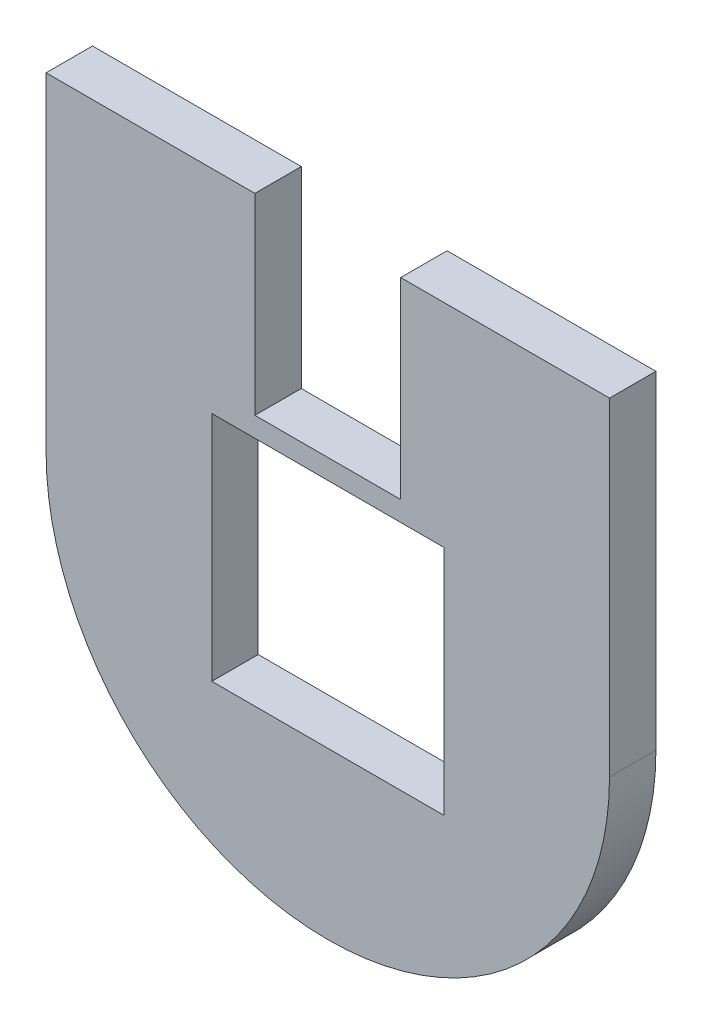
ISO-10303-21;
HEADER;
FILE_DESCRIPTION(('STEP AP214'),'2;1');
FILE_NAME('part.step','',(''),(''),'','','');
FILE_SCHEMA(('AUTOMOTIVE_DESIGN { 1 0 10303 214 1 1 1 1 }'));
ENDSEC;
DATA;
#1=APPLICATION_CONTEXT('core data for automotive mechanical design processes');
#2=APPLICATION_PROTOCOL_DEFINITION('international standard','automotive_design',2000,#1);
#3=PRODUCT_CONTEXT('',#1,'mechanical');
#4=PRODUCT('Part','Part','',(#3));
#5=PRODUCT_RELATED_PRODUCT_CATEGORY('part','',(#4));
#6=PRODUCT_DEFINITION_FORMATION('','',#4);
#7=PRODUCT_DEFINITION_CONTEXT('part definition',#1,'design');
#8=PRODUCT_DEFINITION('design','',#6,#7);
#9=PRODUCT_DEFINITION_SHAPE('','',#8);
#10=(LENGTH_UNIT() NAMED_UNIT(*) SI_UNIT(.MILLI.,.METRE.));
#11=(NAMED_UNIT(*) PLANE_ANGLE_UNIT() SI_UNIT($,.RADIAN.));
#12=(NAMED_UNIT(*) SI_UNIT($,.STERADIAN.) SOLID_ANGLE_UNIT());
#13=UNCERTAINTY_MEASURE_WITH_UNIT(LENGTH_MEASURE(1.E-05),#10,'distance_accuracy_value','');
#14=(GEOMETRIC_REPRESENTATION_CONTEXT(3) GLOBAL_UNCERTAINTY_ASSIGNED_CONTEXT((#13)) GLOBAL_UNIT_ASSIGNED_CONTEXT((#10,
#11,#12)) REPRESENTATION_CONTEXT('',''));
#15=CARTESIAN_POINT('',(0.,0.,0.));
#16=DIRECTION('',(0.,0.,1.));
#17=DIRECTION('',(1.,0.,0.));
#18=AXIS2_PLACEMENT_3D('',#15,#16,#17);
#19=CARTESIAN_POINT('',(0.,0.,7.));
#20=DIRECTION('',(0.,0.,-1.));
#21=DIRECTION('',(-1.,0.,0.));
#22=AXIS2_PLACEMENT_3D('',#19,#20,#21);
#23=PLANE('',#22);
#24=DIRECTION('',(-1.,0.,0.));
#25=VECTOR('',#24,1.);
#26=CARTESIAN_POINT('',(25.,62.5,7.));
#27=LINE('',#26,#25);
#28=CARTESIAN_POINT('',(60.,62.5,7.));
#29=VERTEX_POINT('',#28);
#30=CARTESIAN_POINT('',(25.,62.5,7.));
#31=VERTEX_POINT('',#30);
#32=EDGE_CURVE('E206',#29,#31,#27,.T.);
#33=ORIENTED_EDGE('',*,*,#32,.F.);
#34=DIRECTION('',(0.,1.,0.));
#35=VECTOR('',#34,1.);
#36=CARTESIAN_POINT('',(60.,27.5,7.));
#37=LINE('',#36,#35);
#38=CARTESIAN_POINT('',(60.,27.5,7.));
#39=VERTEX_POINT('',#38);
#40=EDGE_CURVE('E203',#39,#29,#37,.T.);
#41=ORIENTED_EDGE('',*,*,#40,.F.);
#42=DIRECTION('',(1.,0.,0.));
#43=VECTOR('',#42,1.);
#44=CARTESIAN_POINT('',(25.,27.5,7.));
#45=LINE('',#44,#43);
#46=CARTESIAN_POINT('',(25.,27.5,7.));
#47=VERTEX_POINT('',#46);
#48=EDGE_CURVE('E177',#47,#39,#45,.T.);
#49=ORIENTED_EDGE('',*,*,#48,.F.);
#50=DIRECTION('',(0.,-1.,0.));
#51=VECTOR('',#50,1.);
#52=CARTESIAN_POINT('',(25.,27.5,7.));
#53=LINE('',#52,#51);
#54=EDGE_CURVE('E209',#31,#47,#53,.T.);
#55=ORIENTED_EDGE('',*,*,#54,.F.);
#56=EDGE_LOOP('',(#33,#41,#49,#55));
#57=FACE_BOUND('',#56,.T.);
#58=DIRECTION('',(1.,0.,0.));
#59=VECTOR('',#58,1.);
#60=CARTESIAN_POINT('',(0.,94.5,7.));
#61=LINE('',#60,#59);
#62=CARTESIAN_POINT('',(0.,94.5,7.));
#63=VERTEX_POINT('',#62);
#64=CARTESIAN_POINT('',(31.5,94.5,7.));
#65=VERTEX_POINT('',#64);
#66=EDGE_CURVE('E63',#63,#65,#61,.T.);
#67=ORIENTED_EDGE('',*,*,#66,.F.);
#68=DIRECTION('',(0.,-1.,0.));
#69=VECTOR('',#68,1.);
#70=CARTESIAN_POINT('',(0.,0.,7.));
#71=LINE('',#70,#69);
#72=CARTESIAN_POINT('',(0.,45.,7.));
#73=VERTEX_POINT('',#72);
#74=EDGE_CURVE('E55',#63,#73,#71,.T.);
#75=ORIENTED_EDGE('',*,*,#74,.T.);
#76=CARTESIAN_POINT('',(42.5,45.,7.));
#77=DIRECTION('',(0.,0.,-1.));
#78=DIRECTION('',(-1.,0.,0.));
#79=AXIS2_PLACEMENT_3D('',#76,#77,#78);
#80=CIRCLE('',#79,42.5);
#81=CARTESIAN_POINT('',(85.,45.,7.));
#82=VERTEX_POINT('',#81);
#83=EDGE_CURVE('E207',#73,#82,#80,.F.);
#84=ORIENTED_EDGE('',*,*,#83,.T.);
#85=DIRECTION('',(0.,1.,0.));
#86=VECTOR('',#85,1.);
#87=CARTESIAN_POINT('',(85.,0.,7.));
#88=LINE('',#87,#86);
#89=CARTESIAN_POINT('',(85.,94.5,7.));
#90=VERTEX_POINT('',#89);
#91=EDGE_CURVE('E11',#82,#90,#88,.T.);
#92=ORIENTED_EDGE('',*,*,#91,.T.);
#93=DIRECTION('',(1.,0.,0.));
#94=VECTOR('',#93,1.);
#95=CARTESIAN_POINT('',(53.5,94.5,7.));
#96=LINE('',#95,#94);
#97=CARTESIAN_POINT('',(53.5,94.5,7.));
#98=VERTEX_POINT('',#97);
#99=EDGE_CURVE('E261',#98,#90,#96,.T.);
#100=ORIENTED_EDGE('',*,*,#99,.F.);
#101=DIRECTION('',(0.,-1.,0.));
#102=VECTOR('',#101,1.);
#103=CARTESIAN_POINT('',(53.5,0.,7.));
#104=LINE('',#103,#102);
#105=CARTESIAN_POINT('',(53.5,65.5,7.));
#106=VERTEX_POINT('',#105);
#107=EDGE_CURVE('E238',#98,#106,#104,.T.);
#108=ORIENTED_EDGE('',*,*,#107,.T.);
#109=DIRECTION('',(-1.,0.,0.));
#110=VECTOR('',#109,1.);
#111=CARTESIAN_POINT('',(0.,65.5,7.));
#112=LINE('',#111,#110);
#113=CARTESIAN_POINT('',(31.5,65.5,7.));
#114=VERTEX_POINT('',#113);
#115=EDGE_CURVE('E235',#106,#114,#112,.T.);
#116=ORIENTED_EDGE('',*,*,#115,.T.);
#117=DIRECTION('',(0.,-1.,0.));
#118=VECTOR('',#117,1.);
#119=CARTESIAN_POINT('',(31.5,0.,7.));
#120=LINE('',#119,#118);
#121=EDGE_CURVE('E150',#65,#114,#120,.T.);
#122=ORIENTED_EDGE('',*,*,#121,.F.);
#123=EDGE_LOOP('',(#67,#75,#84,#92,#100,#108,#116,#122));
#124=FACE_BOUND('',#123,.T.);
#125=ADVANCED_FACE('F45',(#57,#124),#23,.F.);
#126=CARTESIAN_POINT('',(0.,0.,0.));
#127=DIRECTION('',(0.,0.,-1.));
#128=DIRECTION('',(-1.,0.,0.));
#129=AXIS2_PLACEMENT_3D('',#126,#127,#128);
#130=PLANE('',#129);
#131=DIRECTION('',(0.,1.,0.));
#132=VECTOR('',#131,1.);
#133=CARTESIAN_POINT('',(60.,27.5,0.));
#134=LINE('',#133,#132);
#135=CARTESIAN_POINT('',(60.,27.5,0.));
#136=VERTEX_POINT('',#135);
#137=CARTESIAN_POINT('',(60.,62.5,0.));
#138=VERTEX_POINT('',#137);
#139=EDGE_CURVE('E214',#136,#138,#134,.T.);
#140=ORIENTED_EDGE('',*,*,#139,.T.);
#141=DIRECTION('',(-1.,0.,0.));
#142=VECTOR('',#141,1.);
#143=CARTESIAN_POINT('',(25.,62.5,0.));
#144=LINE('',#143,#142);
#145=CARTESIAN_POINT('',(25.,62.5,0.));
#146=VERTEX_POINT('',#145);
#147=EDGE_CURVE('E199',#138,#146,#144,.T.);
#148=ORIENTED_EDGE('',*,*,#147,.T.);
#149=DIRECTION('',(0.,-1.,0.));
#150=VECTOR('',#149,1.);
#151=CARTESIAN_POINT('',(25.,27.5,0.));
#152=LINE('',#151,#150);
#153=CARTESIAN_POINT('',(25.,27.5,0.));
#154=VERTEX_POINT('',#153);
#155=EDGE_CURVE('E192',#146,#154,#152,.T.);
#156=ORIENTED_EDGE('',*,*,#155,.T.);
#157=DIRECTION('',(1.,0.,0.));
#158=VECTOR('',#157,1.);
#159=CARTESIAN_POINT('',(25.,27.5,0.));
#160=LINE('',#159,#158);
#161=EDGE_CURVE('E186',#154,#136,#160,.T.);
#162=ORIENTED_EDGE('',*,*,#161,.T.);
#163=EDGE_LOOP('',(#140,#148,#156,#162));
#164=FACE_BOUND('',#163,.T.);
#165=DIRECTION('',(0.,-1.,0.));
#166=VECTOR('',#165,1.);
#167=CARTESIAN_POINT('',(0.,0.,0.));
#168=LINE('',#167,#166);
#169=CARTESIAN_POINT('',(0.,94.5,0.));
#170=VERTEX_POINT('',#169);
#171=CARTESIAN_POINT('',(0.,45.,0.));
#172=VERTEX_POINT('',#171);
#173=EDGE_CURVE('E161',#170,#172,#168,.T.);
#174=ORIENTED_EDGE('',*,*,#173,.F.);
#175=DIRECTION('',(-1.,0.,0.));
#176=VECTOR('',#175,1.);
#177=CARTESIAN_POINT('',(0.,94.5,0.));
#178=LINE('',#177,#176);
#179=CARTESIAN_POINT('',(31.5,94.5,0.));
#180=VERTEX_POINT('',#179);
#181=EDGE_CURVE('E138',#180,#170,#178,.T.);
#182=ORIENTED_EDGE('',*,*,#181,.F.);
#183=DIRECTION('',(0.,-1.,0.));
#184=VECTOR('',#183,1.);
#185=CARTESIAN_POINT('',(31.5,0.,0.));
#186=LINE('',#185,#184);
#187=CARTESIAN_POINT('',(31.5,65.5,0.));
#188=VERTEX_POINT('',#187);
#189=EDGE_CURVE('E256',#180,#188,#186,.T.);
#190=ORIENTED_EDGE('',*,*,#189,.T.);
#191=DIRECTION('',(-1.,0.,0.));
#192=VECTOR('',#191,1.);
#193=CARTESIAN_POINT('',(0.,65.5,0.));
#194=LINE('',#193,#192);
#195=CARTESIAN_POINT('',(53.5,65.5,0.));
#196=VERTEX_POINT('',#195);
#197=EDGE_CURVE('E246',#196,#188,#194,.T.);
#198=ORIENTED_EDGE('',*,*,#197,.F.);
#199=DIRECTION('',(0.,-1.,0.));
#200=VECTOR('',#199,1.);
#201=CARTESIAN_POINT('',(53.5,0.,0.));
#202=LINE('',#201,#200);
#203=CARTESIAN_POINT('',(53.5,94.5,0.));
#204=VERTEX_POINT('',#203);
#205=EDGE_CURVE('E253',#204,#196,#202,.T.);
#206=ORIENTED_EDGE('',*,*,#205,.F.);
#207=DIRECTION('',(-1.,0.,0.));
#208=VECTOR('',#207,1.);
#209=CARTESIAN_POINT('',(53.5,94.5,0.));
#210=LINE('',#209,#208);
#211=CARTESIAN_POINT('',(85.,94.5,0.));
#212=VERTEX_POINT('',#211);
#213=EDGE_CURVE('E71',#212,#204,#210,.T.);
#214=ORIENTED_EDGE('',*,*,#213,.F.);
#215=DIRECTION('',(0.,1.,0.));
#216=VECTOR('',#215,1.);
#217=CARTESIAN_POINT('',(85.,0.,0.));
#218=LINE('',#217,#216);
#219=CARTESIAN_POINT('',(85.,45.,0.));
#220=VERTEX_POINT('',#219);
#221=EDGE_CURVE('E49',#220,#212,#218,.T.);
#222=ORIENTED_EDGE('',*,*,#221,.F.);
#223=CARTESIAN_POINT('',(42.5,45.,0.));
#224=DIRECTION('',(0.,0.,1.));
#225=DIRECTION('',(-1.,0.,0.));
#226=AXIS2_PLACEMENT_3D('',#223,#224,#225);
#227=CIRCLE('',#226,42.5);
#228=EDGE_CURVE('E228',#172,#220,#227,.T.);
#229=ORIENTED_EDGE('',*,*,#228,.F.);
#230=EDGE_LOOP('',(#174,#182,#190,#198,#206,#214,#222,#229));
#231=FACE_BOUND('',#230,.T.);
#232=ADVANCED_FACE('F275',(#164,#231),#130,.T.);
#233=CARTESIAN_POINT('',(85.,0.,7.));
#234=DIRECTION('',(-1.,0.,0.));
#235=DIRECTION('',(0.,0.,1.));
#236=AXIS2_PLACEMENT_3D('',#233,#234,#235);
#237=PLANE('',#236);
#238=DIRECTION('',(0.,0.,-1.));
#239=VECTOR('',#238,1.);
#240=CARTESIAN_POINT('',(85.,94.5,0.));
#241=LINE('',#240,#239);
#242=EDGE_CURVE('E264',#90,#212,#241,.T.);
#243=ORIENTED_EDGE('',*,*,#242,.F.);
#244=ORIENTED_EDGE('',*,*,#91,.F.);
#245=DIRECTION('',(0.,0.,-1.));
#246=VECTOR('',#245,1.);
#247=CARTESIAN_POINT('',(85.,45.,10.));
#248=LINE('',#247,#246);
#249=EDGE_CURVE('E224',#82,#220,#248,.T.);
#250=ORIENTED_EDGE('',*,*,#249,.T.);
#251=ORIENTED_EDGE('',*,*,#221,.T.);
#252=EDGE_LOOP('',(#243,#244,#250,#251));
#253=FACE_BOUND('',#252,.T.);
#254=ADVANCED_FACE('F294',(#253),#237,.F.);
#255=CARTESIAN_POINT('',(0.,0.,7.));
#256=DIRECTION('',(1.,0.,0.));
#257=DIRECTION('',(0.,0.,-1.));
#258=AXIS2_PLACEMENT_3D('',#255,#256,#257);
#259=PLANE('',#258);
#260=DIRECTION('',(0.,0.,1.));
#261=VECTOR('',#260,1.);
#262=CARTESIAN_POINT('',(0.,94.5,0.));
#263=LINE('',#262,#261);
#264=EDGE_CURVE('E135',#170,#63,#263,.T.);
#265=ORIENTED_EDGE('',*,*,#264,.F.);
#266=ORIENTED_EDGE('',*,*,#173,.T.);
#267=DIRECTION('',(0.,0.,-1.));
#268=VECTOR('',#267,1.);
#269=CARTESIAN_POINT('',(0.,45.,10.));
#270=LINE('',#269,#268);
#271=EDGE_CURVE('E156',#73,#172,#270,.T.);
#272=ORIENTED_EDGE('',*,*,#271,.F.);
#273=ORIENTED_EDGE('',*,*,#74,.F.);
#274=EDGE_LOOP('',(#265,#266,#272,#273));
#275=FACE_BOUND('',#274,.T.);
#276=ADVANCED_FACE('F47',(#275),#259,.F.);
#277=CARTESIAN_POINT('',(31.5,0.,10.));
#278=DIRECTION('',(1.,0.,0.));
#279=DIRECTION('',(0.,1.,0.));
#280=AXIS2_PLACEMENT_3D('',#277,#278,#279);
#281=PLANE('',#280);
#282=ORIENTED_EDGE('',*,*,#189,.F.);
#283=DIRECTION('',(0.,0.,-1.));
#284=VECTOR('',#283,1.);
#285=CARTESIAN_POINT('',(31.5,94.5,0.));
#286=LINE('',#285,#284);
#287=EDGE_CURVE('E152',#65,#180,#286,.T.);
#288=ORIENTED_EDGE('',*,*,#287,.F.);
#289=ORIENTED_EDGE('',*,*,#121,.T.);
#290=DIRECTION('',(0.,0.,-1.));
#291=VECTOR('',#290,1.);
#292=CARTESIAN_POINT('',(31.5,65.5,10.));
#293=LINE('',#292,#291);
#294=EDGE_CURVE('E241',#114,#188,#293,.T.);
#295=ORIENTED_EDGE('',*,*,#294,.T.);
#296=EDGE_LOOP('',(#282,#288,#289,#295));
#297=FACE_BOUND('',#296,.T.);
#298=ADVANCED_FACE('F278',(#297),#281,.T.);
#299=CARTESIAN_POINT('',(53.5,0.,10.));
#300=DIRECTION('',(1.,0.,0.));
#301=DIRECTION('',(0.,0.,-1.));
#302=AXIS2_PLACEMENT_3D('',#299,#300,#301);
#303=PLANE('',#302);
#304=DIRECTION('',(0.,0.,1.));
#305=VECTOR('',#304,1.);
#306=CARTESIAN_POINT('',(53.5,94.5,0.));
#307=LINE('',#306,#305);
#308=EDGE_CURVE('E143',#204,#98,#307,.T.);
#309=ORIENTED_EDGE('',*,*,#308,.F.);
#310=ORIENTED_EDGE('',*,*,#205,.T.);
#311=DIRECTION('',(0.,0.,-1.));
#312=VECTOR('',#311,1.);
#313=CARTESIAN_POINT('',(53.5,65.5,10.));
#314=LINE('',#313,#312);
#315=EDGE_CURVE('E242',#106,#196,#314,.T.);
#316=ORIENTED_EDGE('',*,*,#315,.F.);
#317=ORIENTED_EDGE('',*,*,#107,.F.);
#318=EDGE_LOOP('',(#309,#310,#316,#317));
#319=FACE_BOUND('',#318,.T.);
#320=ADVANCED_FACE('F287',(#319),#303,.F.);
#321=CARTESIAN_POINT('',(60.,27.5,0.));
#322=DIRECTION('',(1.,0.,0.));
#323=DIRECTION('',(0.,0.,-1.));
#324=AXIS2_PLACEMENT_3D('',#321,#322,#323);
#325=PLANE('',#324);
#326=ORIENTED_EDGE('',*,*,#40,.T.);
#327=DIRECTION('',(0.,0.,1.));
#328=VECTOR('',#327,1.);
#329=CARTESIAN_POINT('',(60.,62.5,0.));
#330=LINE('',#329,#328);
#331=EDGE_CURVE('E163',#138,#29,#330,.T.);
#332=ORIENTED_EDGE('',*,*,#331,.F.);
#333=ORIENTED_EDGE('',*,*,#139,.F.);
#334=DIRECTION('',(0.,0.,1.));
#335=VECTOR('',#334,1.);
#336=CARTESIAN_POINT('',(60.,27.5,0.));
#337=LINE('',#336,#335);
#338=EDGE_CURVE('E166',#136,#39,#337,.T.);
#339=ORIENTED_EDGE('',*,*,#338,.T.);
#340=EDGE_LOOP('',(#326,#332,#333,#339));
#341=FACE_BOUND('',#340,.T.);
#342=ADVANCED_FACE('F317',(#341),#325,.F.);
#343=CARTESIAN_POINT('',(25.,27.5,0.));
#344=DIRECTION('',(0.,-1.,0.));
#345=DIRECTION('',(0.,0.,-1.));
#346=AXIS2_PLACEMENT_3D('',#343,#344,#345);
#347=PLANE('',#346);
#348=ORIENTED_EDGE('',*,*,#48,.T.);
#349=ORIENTED_EDGE('',*,*,#338,.F.);
#350=ORIENTED_EDGE('',*,*,#161,.F.);
#351=DIRECTION('',(0.,0.,1.));
#352=VECTOR('',#351,1.);
#353=CARTESIAN_POINT('',(25.,27.5,0.));
#354=LINE('',#353,#352);
#355=EDGE_CURVE('E168',#154,#47,#354,.T.);
#356=ORIENTED_EDGE('',*,*,#355,.T.);
#357=EDGE_LOOP('',(#348,#349,#350,#356));
#358=FACE_BOUND('',#357,.T.);
#359=ADVANCED_FACE('F385',(#358),#347,.F.);
#360=CARTESIAN_POINT('',(25.,27.5,0.));
#361=DIRECTION('',(-1.,0.,0.));
#362=DIRECTION('',(0.,0.,1.));
#363=AXIS2_PLACEMENT_3D('',#360,#361,#362);
#364=PLANE('',#363);
#365=ORIENTED_EDGE('',*,*,#54,.T.);
#366=ORIENTED_EDGE('',*,*,#355,.F.);
#367=ORIENTED_EDGE('',*,*,#155,.F.);
#368=DIRECTION('',(0.,0.,1.));
#369=VECTOR('',#368,1.);
#370=CARTESIAN_POINT('',(25.,62.5,0.));
#371=LINE('',#370,#369);
#372=EDGE_CURVE('E174',#146,#31,#371,.T.);
#373=ORIENTED_EDGE('',*,*,#372,.T.);
#374=EDGE_LOOP('',(#365,#366,#367,#373));
#375=FACE_BOUND('',#374,.T.);
#376=ADVANCED_FACE('F305',(#375),#364,.F.);
#377=CARTESIAN_POINT('',(25.,62.5,0.));
#378=DIRECTION('',(0.,1.,0.));
#379=DIRECTION('',(0.,0.,1.));
#380=AXIS2_PLACEMENT_3D('',#377,#378,#379);
#381=PLANE('',#380);
#382=ORIENTED_EDGE('',*,*,#32,.T.);
#383=ORIENTED_EDGE('',*,*,#372,.F.);
#384=ORIENTED_EDGE('',*,*,#147,.F.);
#385=ORIENTED_EDGE('',*,*,#331,.T.);
#386=EDGE_LOOP('',(#382,#383,#384,#385));
#387=FACE_BOUND('',#386,.T.);
#388=ADVANCED_FACE('F298',(#387),#381,.F.);
#389=CARTESIAN_POINT('',(42.5,45.,10.));
#390=DIRECTION('',(0.,0.,-1.));
#391=DIRECTION('',(-1.,0.,0.));
#392=AXIS2_PLACEMENT_3D('',#389,#390,#391);
#393=CYLINDRICAL_SURFACE('',#392,42.5);
#394=ORIENTED_EDGE('',*,*,#271,.T.);
#395=ORIENTED_EDGE('',*,*,#228,.T.);
#396=ORIENTED_EDGE('',*,*,#249,.F.);
#397=ORIENTED_EDGE('',*,*,#83,.F.);
#398=EDGE_LOOP('',(#394,#395,#396,#397));
#399=FACE_BOUND('',#398,.T.);
#400=ADVANCED_FACE('F296',(#399),#393,.T.);
#401=CARTESIAN_POINT('',(0.,65.5,10.));
#402=DIRECTION('',(0.,-1.,0.));
#403=DIRECTION('',(0.,0.,-1.));
#404=AXIS2_PLACEMENT_3D('',#401,#402,#403);
#405=PLANE('',#404);
#406=ORIENTED_EDGE('',*,*,#315,.T.);
#407=ORIENTED_EDGE('',*,*,#197,.T.);
#408=ORIENTED_EDGE('',*,*,#294,.F.);
#409=ORIENTED_EDGE('',*,*,#115,.F.);
#410=EDGE_LOOP('',(#406,#407,#408,#409));
#411=FACE_BOUND('',#410,.T.);
#412=ADVANCED_FACE('F282',(#411),#405,.F.);
#413=CARTESIAN_POINT('',(0.,94.5,0.));
#414=DIRECTION('',(0.,1.,0.));
#415=DIRECTION('',(0.,0.,1.));
#416=AXIS2_PLACEMENT_3D('',#413,#414,#415);
#417=PLANE('',#416);
#418=ORIENTED_EDGE('',*,*,#308,.T.);
#419=ORIENTED_EDGE('',*,*,#99,.T.);
#420=ORIENTED_EDGE('',*,*,#242,.T.);
#421=ORIENTED_EDGE('',*,*,#213,.T.);
#422=EDGE_LOOP('',(#418,#419,#420,#421));
#423=FACE_BOUND('',#422,.T.);
#424=ADVANCED_FACE('F290',(#423),#417,.T.);
#425=CARTESIAN_POINT('',(0.,94.5,0.));
#426=DIRECTION('',(0.,1.,0.));
#427=DIRECTION('',(0.,0.,1.));
#428=AXIS2_PLACEMENT_3D('',#425,#426,#427);
#429=PLANE('',#428);
#430=ORIENTED_EDGE('',*,*,#264,.T.);
#431=ORIENTED_EDGE('',*,*,#66,.T.);
#432=ORIENTED_EDGE('',*,*,#287,.T.);
#433=ORIENTED_EDGE('',*,*,#181,.T.);
#434=EDGE_LOOP('',(#430,#431,#432,#433));
#435=FACE_BOUND('',#434,.T.);
#436=ADVANCED_FACE('F136',(#435),#429,.T.);
#437=CLOSED_SHELL('',(#125,#232,#254,#276,#298,#320,#342,#359,#376,#388,#400,#412,#424,#436));
#438=MANIFOLD_SOLID_BREP('B2',#437);
#439=ADVANCED_BREP_SHAPE_REPRESENTATION('',(#18,#438),#14);
#440=SHAPE_DEFINITION_REPRESENTATION(#9,#439);
ENDSEC;
END-ISO-10303-21;
